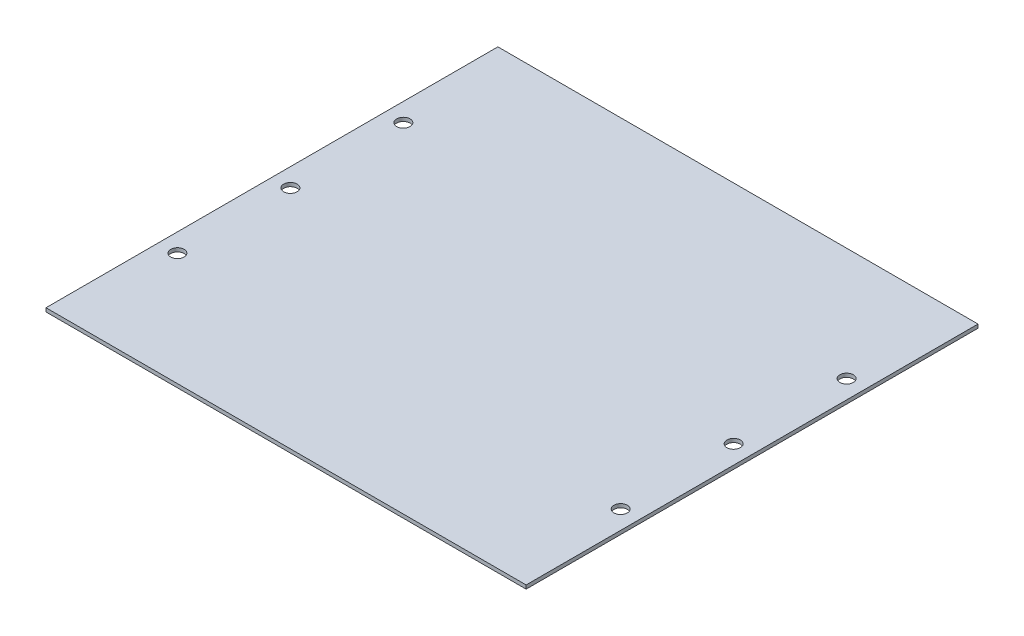
ISO-10303-21;
HEADER;
FILE_DESCRIPTION(('STEP AP214'),'2;1');
FILE_NAME('part.step','',(''),(''),'','','');
FILE_SCHEMA(('AUTOMOTIVE_DESIGN { 1 0 10303 214 1 1 1 1 }'));
ENDSEC;
DATA;
#1=APPLICATION_CONTEXT('core data for automotive mechanical design processes');
#2=APPLICATION_PROTOCOL_DEFINITION('international standard','automotive_design',2000,#1);
#3=PRODUCT_CONTEXT('',#1,'mechanical');
#4=PRODUCT('Part','Part','',(#3));
#5=PRODUCT_RELATED_PRODUCT_CATEGORY('part','',(#4));
#6=PRODUCT_DEFINITION_FORMATION('','',#4);
#7=PRODUCT_DEFINITION_CONTEXT('part definition',#1,'design');
#8=PRODUCT_DEFINITION('design','',#6,#7);
#9=PRODUCT_DEFINITION_SHAPE('','',#8);
#10=(LENGTH_UNIT() NAMED_UNIT(*) SI_UNIT(.MILLI.,.METRE.));
#11=(NAMED_UNIT(*) PLANE_ANGLE_UNIT() SI_UNIT($,.RADIAN.));
#12=(NAMED_UNIT(*) SI_UNIT($,.STERADIAN.) SOLID_ANGLE_UNIT());
#13=UNCERTAINTY_MEASURE_WITH_UNIT(LENGTH_MEASURE(1.E-05),#10,'distance_accuracy_value','');
#14=(GEOMETRIC_REPRESENTATION_CONTEXT(3) GLOBAL_UNCERTAINTY_ASSIGNED_CONTEXT((#13)) GLOBAL_UNIT_ASSIGNED_CONTEXT((#10,
#11,#12)) REPRESENTATION_CONTEXT('',''));
#15=CARTESIAN_POINT('',(0.,0.,0.));
#16=DIRECTION('',(0.,0.,1.));
#17=DIRECTION('',(1.,0.,0.));
#18=AXIS2_PLACEMENT_3D('',#15,#16,#17);
#19=CARTESIAN_POINT('',(0.,2.4765,0.));
#20=DIRECTION('',(0.,1.,0.));
#21=DIRECTION('',(0.,0.,1.));
#22=AXIS2_PLACEMENT_3D('',#19,#20,#21);
#23=PLANE('',#22);
#24=CARTESIAN_POINT('',(6.07050093474581,2.4765,304.088133901));
#25=DIRECTION('',(0.,1.,0.));
#26=DIRECTION('',(0.,0.,1.));
#27=AXIS2_PLACEMENT_3D('',#24,#25,#26);
#28=CIRCLE('',#27,4.51976328493262);
#29=CARTESIAN_POINT('',(6.07050093474581,2.4765,308.607897185933));
#30=VERTEX_POINT('',#29);
#31=EDGE_CURVE('E158',#30,#30,#28,.T.);
#32=ORIENTED_EDGE('',*,*,#31,.F.);
#33=EDGE_LOOP('',(#32));
#34=FACE_BOUND('',#33,.T.);
#35=CARTESIAN_POINT('',(-292.887499065254,2.4765,380.288133901));
#36=DIRECTION('',(0.,1.,0.));
#37=DIRECTION('',(0.,0.,1.));
#38=AXIS2_PLACEMENT_3D('',#35,#36,#37);
#39=CIRCLE('',#38,4.51976328493261);
#40=CARTESIAN_POINT('',(-292.887499065254,2.4765,384.807897185933));
#41=VERTEX_POINT('',#40);
#42=EDGE_CURVE('E142',#41,#41,#39,.T.);
#43=ORIENTED_EDGE('',*,*,#42,.F.);
#44=EDGE_LOOP('',(#43));
#45=FACE_BOUND('',#44,.T.);
#46=CARTESIAN_POINT('',(-292.887499065254,2.4765,227.888133901));
#47=DIRECTION('',(0.,1.,0.));
#48=DIRECTION('',(0.,0.,1.));
#49=AXIS2_PLACEMENT_3D('',#46,#47,#48);
#50=CIRCLE('',#49,4.5197632849326);
#51=CARTESIAN_POINT('',(-292.887499065254,2.4765,232.407897185933));
#52=VERTEX_POINT('',#51);
#53=EDGE_CURVE('E112',#52,#52,#50,.T.);
#54=ORIENTED_EDGE('',*,*,#53,.F.);
#55=EDGE_LOOP('',(#54));
#56=FACE_BOUND('',#55,.T.);
#57=DIRECTION('',(0.,0.,1.));
#58=VECTOR('',#57,1.);
#59=CARTESIAN_POINT('',(-305.333499065254,2.4765,151.688133901));
#60=LINE('',#59,#58);
#61=CARTESIAN_POINT('',(-305.333499065254,2.4765,151.688133901));
#62=VERTEX_POINT('',#61);
#63=CARTESIAN_POINT('',(-305.333499065254,2.4765,456.488133901));
#64=VERTEX_POINT('',#63);
#65=EDGE_CURVE('E92',#62,#64,#60,.T.);
#66=ORIENTED_EDGE('',*,*,#65,.T.);
#67=DIRECTION('',(1.,0.,0.));
#68=VECTOR('',#67,1.);
#69=CARTESIAN_POINT('',(-305.333499065254,2.4765,456.488133901));
#70=LINE('',#69,#68);
#71=CARTESIAN_POINT('',(18.5165009347458,2.4765,456.488133901));
#72=VERTEX_POINT('',#71);
#73=EDGE_CURVE('E87',#64,#72,#70,.T.);
#74=ORIENTED_EDGE('',*,*,#73,.T.);
#75=DIRECTION('',(0.,0.,-1.));
#76=VECTOR('',#75,1.);
#77=CARTESIAN_POINT('',(18.5165009347458,2.4765,151.688133901));
#78=LINE('',#77,#76);
#79=CARTESIAN_POINT('',(18.5165009347458,2.4765,151.688133901));
#80=VERTEX_POINT('',#79);
#81=EDGE_CURVE('E90',#72,#80,#78,.T.);
#82=ORIENTED_EDGE('',*,*,#81,.T.);
#83=DIRECTION('',(-1.,0.,0.));
#84=VECTOR('',#83,1.);
#85=CARTESIAN_POINT('',(-305.333499065254,2.4765,151.688133901));
#86=LINE('',#85,#84);
#87=EDGE_CURVE('E57',#80,#62,#86,.T.);
#88=ORIENTED_EDGE('',*,*,#87,.T.);
#89=EDGE_LOOP('',(#66,#74,#82,#88));
#90=FACE_BOUND('',#89,.T.);
#91=CARTESIAN_POINT('',(-292.887499065254,2.4765,304.088133901));
#92=DIRECTION('',(0.,1.,0.));
#93=DIRECTION('',(0.,0.,1.));
#94=AXIS2_PLACEMENT_3D('',#91,#92,#93);
#95=CIRCLE('',#94,4.51976328493261);
#96=CARTESIAN_POINT('',(-292.887499065254,2.4765,308.607897185933));
#97=VERTEX_POINT('',#96);
#98=EDGE_CURVE('E134',#97,#97,#95,.T.);
#99=ORIENTED_EDGE('',*,*,#98,.F.);
#100=EDGE_LOOP('',(#99));
#101=FACE_BOUND('',#100,.T.);
#102=CARTESIAN_POINT('',(6.0705009347458,2.4765,227.888133901));
#103=DIRECTION('',(0.,1.,0.));
#104=DIRECTION('',(0.,0.,1.));
#105=AXIS2_PLACEMENT_3D('',#102,#103,#104);
#106=CIRCLE('',#105,4.51976328493262);
#107=CARTESIAN_POINT('',(6.0705009347458,2.4765,232.407897185933));
#108=VERTEX_POINT('',#107);
#109=EDGE_CURVE('E150',#108,#108,#106,.T.);
#110=ORIENTED_EDGE('',*,*,#109,.F.);
#111=EDGE_LOOP('',(#110));
#112=FACE_BOUND('',#111,.T.);
#113=CARTESIAN_POINT('',(6.07050093474587,2.4765,380.288133901));
#114=DIRECTION('',(0.,1.,0.));
#115=DIRECTION('',(0.,0.,1.));
#116=AXIS2_PLACEMENT_3D('',#113,#114,#115);
#117=CIRCLE('',#116,4.51976328493262);
#118=CARTESIAN_POINT('',(6.07050093474587,2.4765,384.807897185933));
#119=VERTEX_POINT('',#118);
#120=EDGE_CURVE('E166',#119,#119,#117,.T.);
#121=ORIENTED_EDGE('',*,*,#120,.F.);
#122=EDGE_LOOP('',(#121));
#123=FACE_BOUND('',#122,.T.);
#124=ADVANCED_FACE('F39',(#34,#45,#56,#90,#101,#112,#123),#23,.T.);
#125=CARTESIAN_POINT('',(0.,0.,0.));
#126=DIRECTION('',(0.,1.,0.));
#127=DIRECTION('',(0.,0.,1.));
#128=AXIS2_PLACEMENT_3D('',#125,#126,#127);
#129=PLANE('',#128);
#130=DIRECTION('',(0.,0.,1.));
#131=VECTOR('',#130,1.);
#132=CARTESIAN_POINT('',(-305.333499065254,0.,151.688133901));
#133=LINE('',#132,#131);
#134=CARTESIAN_POINT('',(-305.333499065254,0.,151.688133901));
#135=VERTEX_POINT('',#134);
#136=CARTESIAN_POINT('',(-305.333499065254,0.,456.488133901));
#137=VERTEX_POINT('',#136);
#138=EDGE_CURVE('E108',#135,#137,#133,.T.);
#139=ORIENTED_EDGE('',*,*,#138,.F.);
#140=DIRECTION('',(-1.,0.,0.));
#141=VECTOR('',#140,1.);
#142=CARTESIAN_POINT('',(-305.333499065254,0.,151.688133901));
#143=LINE('',#142,#141);
#144=CARTESIAN_POINT('',(18.5165009347458,0.,151.688133901));
#145=VERTEX_POINT('',#144);
#146=EDGE_CURVE('E80',#145,#135,#143,.T.);
#147=ORIENTED_EDGE('',*,*,#146,.F.);
#148=DIRECTION('',(0.,0.,-1.));
#149=VECTOR('',#148,1.);
#150=CARTESIAN_POINT('',(18.5165009347458,0.,151.688133901));
#151=LINE('',#150,#149);
#152=CARTESIAN_POINT('',(18.5165009347458,0.,456.488133901));
#153=VERTEX_POINT('',#152);
#154=EDGE_CURVE('E74',#153,#145,#151,.T.);
#155=ORIENTED_EDGE('',*,*,#154,.F.);
#156=DIRECTION('',(1.,0.,0.));
#157=VECTOR('',#156,1.);
#158=CARTESIAN_POINT('',(-305.333499065254,0.,456.488133901));
#159=LINE('',#158,#157);
#160=EDGE_CURVE('E97',#137,#153,#159,.T.);
#161=ORIENTED_EDGE('',*,*,#160,.F.);
#162=EDGE_LOOP('',(#139,#147,#155,#161));
#163=FACE_BOUND('',#162,.T.);
#164=CARTESIAN_POINT('',(-292.887499065254,0.,227.888133901));
#165=DIRECTION('',(0.,1.,0.));
#166=DIRECTION('',(0.,0.,1.));
#167=AXIS2_PLACEMENT_3D('',#164,#165,#166);
#168=CIRCLE('',#167,4.5197632849326);
#169=CARTESIAN_POINT('',(-292.887499065254,0.,232.407897185933));
#170=VERTEX_POINT('',#169);
#171=EDGE_CURVE('E130',#170,#170,#168,.T.);
#172=ORIENTED_EDGE('',*,*,#171,.T.);
#173=EDGE_LOOP('',(#172));
#174=FACE_BOUND('',#173,.T.);
#175=CARTESIAN_POINT('',(-292.887499065254,0.,304.088133901));
#176=DIRECTION('',(0.,1.,0.));
#177=DIRECTION('',(0.,0.,1.));
#178=AXIS2_PLACEMENT_3D('',#175,#176,#177);
#179=CIRCLE('',#178,4.51976328493261);
#180=CARTESIAN_POINT('',(-292.887499065254,0.,308.607897185933));
#181=VERTEX_POINT('',#180);
#182=EDGE_CURVE('E138',#181,#181,#179,.T.);
#183=ORIENTED_EDGE('',*,*,#182,.T.);
#184=EDGE_LOOP('',(#183));
#185=FACE_BOUND('',#184,.T.);
#186=CARTESIAN_POINT('',(-292.887499065254,0.,380.288133901));
#187=DIRECTION('',(0.,1.,0.));
#188=DIRECTION('',(0.,0.,1.));
#189=AXIS2_PLACEMENT_3D('',#186,#187,#188);
#190=CIRCLE('',#189,4.51976328493261);
#191=CARTESIAN_POINT('',(-292.887499065254,0.,384.807897185933));
#192=VERTEX_POINT('',#191);
#193=EDGE_CURVE('E146',#192,#192,#190,.T.);
#194=ORIENTED_EDGE('',*,*,#193,.T.);
#195=EDGE_LOOP('',(#194));
#196=FACE_BOUND('',#195,.T.);
#197=CARTESIAN_POINT('',(6.0705009347458,0.,227.888133901));
#198=DIRECTION('',(0.,1.,0.));
#199=DIRECTION('',(0.,0.,1.));
#200=AXIS2_PLACEMENT_3D('',#197,#198,#199);
#201=CIRCLE('',#200,4.51976328493262);
#202=CARTESIAN_POINT('',(6.0705009347458,0.,232.407897185933));
#203=VERTEX_POINT('',#202);
#204=EDGE_CURVE('E154',#203,#203,#201,.T.);
#205=ORIENTED_EDGE('',*,*,#204,.T.);
#206=EDGE_LOOP('',(#205));
#207=FACE_BOUND('',#206,.T.);
#208=CARTESIAN_POINT('',(6.07050093474581,0.,304.088133901));
#209=DIRECTION('',(0.,1.,0.));
#210=DIRECTION('',(0.,0.,1.));
#211=AXIS2_PLACEMENT_3D('',#208,#209,#210);
#212=CIRCLE('',#211,4.51976328493262);
#213=CARTESIAN_POINT('',(6.07050093474581,0.,308.607897185933));
#214=VERTEX_POINT('',#213);
#215=EDGE_CURVE('E162',#214,#214,#212,.T.);
#216=ORIENTED_EDGE('',*,*,#215,.T.);
#217=EDGE_LOOP('',(#216));
#218=FACE_BOUND('',#217,.T.);
#219=CARTESIAN_POINT('',(6.07050093474587,0.,380.288133901));
#220=DIRECTION('',(0.,1.,0.));
#221=DIRECTION('',(0.,0.,1.));
#222=AXIS2_PLACEMENT_3D('',#219,#220,#221);
#223=CIRCLE('',#222,4.51976328493262);
#224=CARTESIAN_POINT('',(6.07050093474587,0.,384.807897185933));
#225=VERTEX_POINT('',#224);
#226=EDGE_CURVE('E170',#225,#225,#223,.T.);
#227=ORIENTED_EDGE('',*,*,#226,.T.);
#228=EDGE_LOOP('',(#227));
#229=FACE_BOUND('',#228,.T.);
#230=ADVANCED_FACE('F125',(#163,#174,#185,#196,#207,#218,#229),#129,.F.);
#231=CARTESIAN_POINT('',(-305.333499065254,2.4765,151.688133901));
#232=DIRECTION('',(1.,0.,0.));
#233=DIRECTION('',(0.,0.,-1.));
#234=AXIS2_PLACEMENT_3D('',#231,#232,#233);
#235=PLANE('',#234);
#236=ORIENTED_EDGE('',*,*,#138,.T.);
#237=DIRECTION('',(0.,-1.,0.));
#238=VECTOR('',#237,1.);
#239=CARTESIAN_POINT('',(-305.333499065254,2.4765,456.488133901));
#240=LINE('',#239,#238);
#241=EDGE_CURVE('E11',#64,#137,#240,.T.);
#242=ORIENTED_EDGE('',*,*,#241,.F.);
#243=ORIENTED_EDGE('',*,*,#65,.F.);
#244=DIRECTION('',(0.,-1.,0.));
#245=VECTOR('',#244,1.);
#246=CARTESIAN_POINT('',(-305.333499065254,2.4765,151.688133901));
#247=LINE('',#246,#245);
#248=EDGE_CURVE('E104',#62,#135,#247,.T.);
#249=ORIENTED_EDGE('',*,*,#248,.T.);
#250=EDGE_LOOP('',(#236,#242,#243,#249));
#251=FACE_BOUND('',#250,.T.);
#252=ADVANCED_FACE('F41',(#251),#235,.F.);
#253=CARTESIAN_POINT('',(-305.333499065254,2.4765,456.488133901));
#254=DIRECTION('',(0.,0.,-1.));
#255=DIRECTION('',(-1.,0.,0.));
#256=AXIS2_PLACEMENT_3D('',#253,#254,#255);
#257=PLANE('',#256);
#258=ORIENTED_EDGE('',*,*,#160,.T.);
#259=DIRECTION('',(0.,-1.,0.));
#260=VECTOR('',#259,1.);
#261=CARTESIAN_POINT('',(18.5165009347458,2.4765,456.488133901));
#262=LINE('',#261,#260);
#263=EDGE_CURVE('E49',#72,#153,#262,.T.);
#264=ORIENTED_EDGE('',*,*,#263,.F.);
#265=ORIENTED_EDGE('',*,*,#73,.F.);
#266=ORIENTED_EDGE('',*,*,#241,.T.);
#267=EDGE_LOOP('',(#258,#264,#265,#266));
#268=FACE_BOUND('',#267,.T.);
#269=ADVANCED_FACE('F96',(#268),#257,.F.);
#270=CARTESIAN_POINT('',(18.5165009347458,2.4765,151.688133901));
#271=DIRECTION('',(-1.,0.,0.));
#272=DIRECTION('',(0.,0.,1.));
#273=AXIS2_PLACEMENT_3D('',#270,#271,#272);
#274=PLANE('',#273);
#275=ORIENTED_EDGE('',*,*,#154,.T.);
#276=DIRECTION('',(0.,-1.,0.));
#277=VECTOR('',#276,1.);
#278=CARTESIAN_POINT('',(18.5165009347458,2.4765,151.688133901));
#279=LINE('',#278,#277);
#280=EDGE_CURVE('E99',#80,#145,#279,.T.);
#281=ORIENTED_EDGE('',*,*,#280,.F.);
#282=ORIENTED_EDGE('',*,*,#81,.F.);
#283=ORIENTED_EDGE('',*,*,#263,.T.);
#284=EDGE_LOOP('',(#275,#281,#282,#283));
#285=FACE_BOUND('',#284,.T.);
#286=ADVANCED_FACE('F100',(#285),#274,.F.);
#287=CARTESIAN_POINT('',(-305.333499065254,2.4765,151.688133901));
#288=DIRECTION('',(0.,0.,1.));
#289=DIRECTION('',(1.,0.,0.));
#290=AXIS2_PLACEMENT_3D('',#287,#288,#289);
#291=PLANE('',#290);
#292=ORIENTED_EDGE('',*,*,#146,.T.);
#293=ORIENTED_EDGE('',*,*,#248,.F.);
#294=ORIENTED_EDGE('',*,*,#87,.F.);
#295=ORIENTED_EDGE('',*,*,#280,.T.);
#296=EDGE_LOOP('',(#292,#293,#294,#295));
#297=FACE_BOUND('',#296,.T.);
#298=ADVANCED_FACE('F122',(#297),#291,.F.);
#299=CARTESIAN_POINT('',(-292.887499065254,2.4765,227.888133901));
#300=DIRECTION('',(0.,-1.,0.));
#301=DIRECTION('',(0.,0.,-1.));
#302=AXIS2_PLACEMENT_3D('',#299,#300,#301);
#303=CYLINDRICAL_SURFACE('',#302,4.5197632849326);
#304=ORIENTED_EDGE('',*,*,#53,.T.);
#305=EDGE_LOOP('',(#304));
#306=FACE_BOUND('',#305,.T.);
#307=ORIENTED_EDGE('',*,*,#171,.F.);
#308=EDGE_LOOP('',(#307));
#309=FACE_BOUND('',#308,.T.);
#310=ADVANCED_FACE('F191',(#306,#309),#303,.F.);
#311=CARTESIAN_POINT('',(-292.887499065254,2.4765,304.088133901));
#312=DIRECTION('',(0.,-1.,0.));
#313=DIRECTION('',(0.,0.,-1.));
#314=AXIS2_PLACEMENT_3D('',#311,#312,#313);
#315=CYLINDRICAL_SURFACE('',#314,4.51976328493261);
#316=ORIENTED_EDGE('',*,*,#98,.T.);
#317=EDGE_LOOP('',(#316));
#318=FACE_BOUND('',#317,.T.);
#319=ORIENTED_EDGE('',*,*,#182,.F.);
#320=EDGE_LOOP('',(#319));
#321=FACE_BOUND('',#320,.T.);
#322=ADVANCED_FACE('F237',(#318,#321),#315,.F.);
#323=CARTESIAN_POINT('',(-292.887499065254,2.4765,380.288133901));
#324=DIRECTION('',(0.,-1.,0.));
#325=DIRECTION('',(0.,0.,-1.));
#326=AXIS2_PLACEMENT_3D('',#323,#324,#325);
#327=CYLINDRICAL_SURFACE('',#326,4.51976328493261);
#328=ORIENTED_EDGE('',*,*,#42,.T.);
#329=EDGE_LOOP('',(#328));
#330=FACE_BOUND('',#329,.T.);
#331=ORIENTED_EDGE('',*,*,#193,.F.);
#332=EDGE_LOOP('',(#331));
#333=FACE_BOUND('',#332,.T.);
#334=ADVANCED_FACE('F245',(#330,#333),#327,.F.);
#335=CARTESIAN_POINT('',(6.0705009347458,2.4765,227.888133901));
#336=DIRECTION('',(0.,-1.,0.));
#337=DIRECTION('',(0.,0.,-1.));
#338=AXIS2_PLACEMENT_3D('',#335,#336,#337);
#339=CYLINDRICAL_SURFACE('',#338,4.51976328493262);
#340=ORIENTED_EDGE('',*,*,#109,.T.);
#341=EDGE_LOOP('',(#340));
#342=FACE_BOUND('',#341,.T.);
#343=ORIENTED_EDGE('',*,*,#204,.F.);
#344=EDGE_LOOP('',(#343));
#345=FACE_BOUND('',#344,.T.);
#346=ADVANCED_FACE('F253',(#342,#345),#339,.F.);
#347=CARTESIAN_POINT('',(6.07050093474581,2.4765,304.088133901));
#348=DIRECTION('',(0.,-1.,0.));
#349=DIRECTION('',(0.,0.,-1.));
#350=AXIS2_PLACEMENT_3D('',#347,#348,#349);
#351=CYLINDRICAL_SURFACE('',#350,4.51976328493262);
#352=ORIENTED_EDGE('',*,*,#31,.T.);
#353=EDGE_LOOP('',(#352));
#354=FACE_BOUND('',#353,.T.);
#355=ORIENTED_EDGE('',*,*,#215,.F.);
#356=EDGE_LOOP('',(#355));
#357=FACE_BOUND('',#356,.T.);
#358=ADVANCED_FACE('F262',(#354,#357),#351,.F.);
#359=CARTESIAN_POINT('',(6.07050093474587,2.4765,380.288133901));
#360=DIRECTION('',(0.,-1.,0.));
#361=DIRECTION('',(0.,0.,-1.));
#362=AXIS2_PLACEMENT_3D('',#359,#360,#361);
#363=CYLINDRICAL_SURFACE('',#362,4.51976328493262);
#364=ORIENTED_EDGE('',*,*,#120,.T.);
#365=EDGE_LOOP('',(#364));
#366=FACE_BOUND('',#365,.T.);
#367=ORIENTED_EDGE('',*,*,#226,.F.);
#368=EDGE_LOOP('',(#367));
#369=FACE_BOUND('',#368,.T.);
#370=ADVANCED_FACE('F178',(#366,#369),#363,.F.);
#371=CLOSED_SHELL('',(#124,#230,#252,#269,#286,#298,#310,#322,#334,#346,#358,#370));
#372=MANIFOLD_SOLID_BREP('B2',#371);
#373=ADVANCED_BREP_SHAPE_REPRESENTATION('',(#18,#372),#14);
#374=SHAPE_DEFINITION_REPRESENTATION(#9,#373);
ENDSEC;
END-ISO-10303-21;
